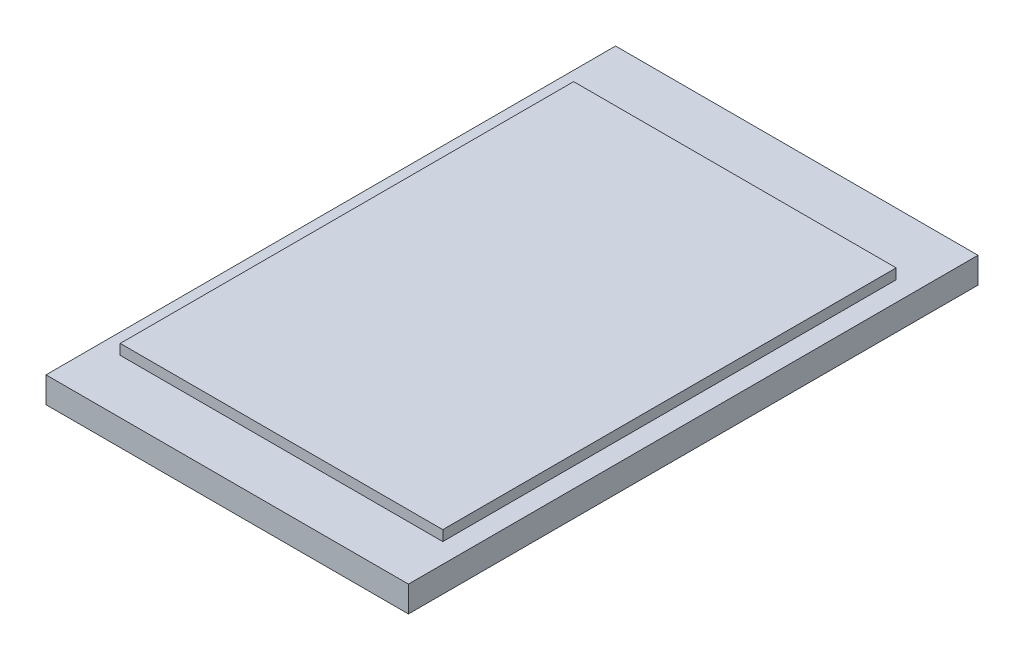
ISO-10303-21;
HEADER;
FILE_DESCRIPTION(('STEP AP214'),'2;1');
FILE_NAME('part.step','',(''),(''),'','','');
FILE_SCHEMA(('AUTOMOTIVE_DESIGN { 1 0 10303 214 1 1 1 1 }'));
ENDSEC;
DATA;
#1=APPLICATION_CONTEXT('core data for automotive mechanical design processes');
#2=APPLICATION_PROTOCOL_DEFINITION('international standard','automotive_design',2000,#1);
#3=PRODUCT_CONTEXT('',#1,'mechanical');
#4=PRODUCT('Part','Part','',(#3));
#5=PRODUCT_RELATED_PRODUCT_CATEGORY('part','',(#4));
#6=PRODUCT_DEFINITION_FORMATION('','',#4);
#7=PRODUCT_DEFINITION_CONTEXT('part definition',#1,'design');
#8=PRODUCT_DEFINITION('design','',#6,#7);
#9=PRODUCT_DEFINITION_SHAPE('','',#8);
#10=(LENGTH_UNIT() NAMED_UNIT(*) SI_UNIT(.MILLI.,.METRE.));
#11=(NAMED_UNIT(*) PLANE_ANGLE_UNIT() SI_UNIT($,.RADIAN.));
#12=(NAMED_UNIT(*) SI_UNIT($,.STERADIAN.) SOLID_ANGLE_UNIT());
#13=UNCERTAINTY_MEASURE_WITH_UNIT(LENGTH_MEASURE(1.E-05),#10,'distance_accuracy_value','');
#14=(GEOMETRIC_REPRESENTATION_CONTEXT(3) GLOBAL_UNCERTAINTY_ASSIGNED_CONTEXT((#13)) GLOBAL_UNIT_ASSIGNED_CONTEXT((#10,
#11,#12)) REPRESENTATION_CONTEXT('',''));
#15=CARTESIAN_POINT('',(0.,0.,0.));
#16=DIRECTION('',(0.,0.,1.));
#17=DIRECTION('',(1.,0.,0.));
#18=AXIS2_PLACEMENT_3D('',#15,#16,#17);
#19=CARTESIAN_POINT('',(-79.0291262135922,5.,-64.0776699029125));
#20=DIRECTION('',(1.,0.,0.));
#21=DIRECTION('',(0.,0.,-1.));
#22=AXIS2_PLACEMENT_3D('',#19,#20,#21);
#23=PLANE('',#22);
#24=DIRECTION('',(0.,0.,1.));
#25=VECTOR('',#24,1.);
#26=CARTESIAN_POINT('',(-79.0291262135922,0.,-64.0776699029125));
#27=LINE('',#26,#25);
#28=CARTESIAN_POINT('',(-79.0291262135922,0.,-64.0776699029125));
#29=VERTEX_POINT('',#28);
#30=CARTESIAN_POINT('',(-79.0291262135922,0.,45.9223300970875));
#31=VERTEX_POINT('',#30);
#32=EDGE_CURVE('E124',#29,#31,#27,.T.);
#33=ORIENTED_EDGE('',*,*,#32,.T.);
#34=DIRECTION('',(0.,-1.,0.));
#35=VECTOR('',#34,1.);
#36=CARTESIAN_POINT('',(-79.0291262135922,5.,45.9223300970875));
#37=LINE('',#36,#35);
#38=CARTESIAN_POINT('',(-79.0291262135922,5.,45.9223300970875));
#39=VERTEX_POINT('',#38);
#40=EDGE_CURVE('E11',#39,#31,#37,.T.);
#41=ORIENTED_EDGE('',*,*,#40,.F.);
#42=DIRECTION('',(0.,0.,1.));
#43=VECTOR('',#42,1.);
#44=CARTESIAN_POINT('',(-79.0291262135922,5.,-64.0776699029125));
#45=LINE('',#44,#43);
#46=CARTESIAN_POINT('',(-79.0291262135922,5.,-64.0776699029125));
#47=VERTEX_POINT('',#46);
#48=EDGE_CURVE('E133',#47,#39,#45,.T.);
#49=ORIENTED_EDGE('',*,*,#48,.F.);
#50=DIRECTION('',(0.,-1.,0.));
#51=VECTOR('',#50,1.);
#52=CARTESIAN_POINT('',(-79.0291262135922,5.,-64.0776699029125));
#53=LINE('',#52,#51);
#54=EDGE_CURVE('E142',#47,#29,#53,.T.);
#55=ORIENTED_EDGE('',*,*,#54,.T.);
#56=EDGE_LOOP('',(#33,#41,#49,#55));
#57=FACE_BOUND('',#56,.T.);
#58=ADVANCED_FACE('F40',(#57),#23,.F.);
#59=CARTESIAN_POINT('',(-79.0291262135922,5.,45.9223300970875));
#60=DIRECTION('',(0.,0.,-1.));
#61=DIRECTION('',(-1.,0.,0.));
#62=AXIS2_PLACEMENT_3D('',#59,#60,#61);
#63=PLANE('',#62);
#64=DIRECTION('',(1.,0.,0.));
#65=VECTOR('',#64,1.);
#66=CARTESIAN_POINT('',(-79.0291262135922,0.,45.9223300970875));
#67=LINE('',#66,#65);
#68=CARTESIAN_POINT('',(-9.02912621359225,0.,45.9223300970875));
#69=VERTEX_POINT('',#68);
#70=EDGE_CURVE('E127',#31,#69,#67,.T.);
#71=ORIENTED_EDGE('',*,*,#70,.T.);
#72=DIRECTION('',(0.,-1.,0.));
#73=VECTOR('',#72,1.);
#74=CARTESIAN_POINT('',(-9.02912621359225,5.,45.9223300970875));
#75=LINE('',#74,#73);
#76=CARTESIAN_POINT('',(-9.02912621359225,5.,45.9223300970875));
#77=VERTEX_POINT('',#76);
#78=EDGE_CURVE('E47',#77,#69,#75,.T.);
#79=ORIENTED_EDGE('',*,*,#78,.F.);
#80=DIRECTION('',(1.,0.,0.));
#81=VECTOR('',#80,1.);
#82=CARTESIAN_POINT('',(-79.0291262135922,5.,45.9223300970875));
#83=LINE('',#82,#81);
#84=EDGE_CURVE('E136',#39,#77,#83,.T.);
#85=ORIENTED_EDGE('',*,*,#84,.F.);
#86=ORIENTED_EDGE('',*,*,#40,.T.);
#87=EDGE_LOOP('',(#71,#79,#85,#86));
#88=FACE_BOUND('',#87,.T.);
#89=ADVANCED_FACE('F173',(#88),#63,.F.);
#90=CARTESIAN_POINT('',(-9.02912621359227,5.,-64.0776699029125));
#91=DIRECTION('',(-1.,0.,0.));
#92=DIRECTION('',(0.,0.,1.));
#93=AXIS2_PLACEMENT_3D('',#90,#91,#92);
#94=PLANE('',#93);
#95=DIRECTION('',(0.,0.,-1.));
#96=VECTOR('',#95,1.);
#97=CARTESIAN_POINT('',(-9.02912621359227,0.,-64.0776699029125));
#98=LINE('',#97,#96);
#99=CARTESIAN_POINT('',(-9.02912621359227,0.,-64.0776699029125));
#100=VERTEX_POINT('',#99);
#101=EDGE_CURVE('E145',#69,#100,#98,.T.);
#102=ORIENTED_EDGE('',*,*,#101,.T.);
#103=DIRECTION('',(0.,-1.,0.));
#104=VECTOR('',#103,1.);
#105=CARTESIAN_POINT('',(-9.02912621359227,5.,-64.0776699029125));
#106=LINE('',#105,#104);
#107=CARTESIAN_POINT('',(-9.02912621359227,5.,-64.0776699029125));
#108=VERTEX_POINT('',#107);
#109=EDGE_CURVE('E150',#108,#100,#106,.T.);
#110=ORIENTED_EDGE('',*,*,#109,.F.);
#111=DIRECTION('',(0.,0.,-1.));
#112=VECTOR('',#111,1.);
#113=CARTESIAN_POINT('',(-9.02912621359227,5.,-64.0776699029125));
#114=LINE('',#113,#112);
#115=EDGE_CURVE('E139',#77,#108,#114,.T.);
#116=ORIENTED_EDGE('',*,*,#115,.F.);
#117=ORIENTED_EDGE('',*,*,#78,.T.);
#118=EDGE_LOOP('',(#102,#110,#116,#117));
#119=FACE_BOUND('',#118,.T.);
#120=ADVANCED_FACE('F157',(#119),#94,.F.);
#121=CARTESIAN_POINT('',(-79.0291262135922,5.,-64.0776699029125));
#122=DIRECTION('',(0.,0.,1.));
#123=DIRECTION('',(1.,0.,0.));
#124=AXIS2_PLACEMENT_3D('',#121,#122,#123);
#125=PLANE('',#124);
#126=DIRECTION('',(-1.,0.,0.));
#127=VECTOR('',#126,1.);
#128=CARTESIAN_POINT('',(-79.0291262135922,0.,-64.0776699029125));
#129=LINE('',#128,#127);
#130=EDGE_CURVE('E137',#100,#29,#129,.T.);
#131=ORIENTED_EDGE('',*,*,#130,.T.);
#132=ORIENTED_EDGE('',*,*,#54,.F.);
#133=DIRECTION('',(-1.,0.,0.));
#134=VECTOR('',#133,1.);
#135=CARTESIAN_POINT('',(-79.0291262135922,5.,-64.0776699029125));
#136=LINE('',#135,#134);
#137=EDGE_CURVE('E141',#108,#47,#136,.T.);
#138=ORIENTED_EDGE('',*,*,#137,.F.);
#139=ORIENTED_EDGE('',*,*,#109,.T.);
#140=EDGE_LOOP('',(#131,#132,#138,#139));
#141=FACE_BOUND('',#140,.T.);
#142=ADVANCED_FACE('F166',(#141),#125,.F.);
#143=CARTESIAN_POINT('',(0.,5.,0.));
#144=DIRECTION('',(0.,1.,0.));
#145=DIRECTION('',(0.,0.,1.));
#146=AXIS2_PLACEMENT_3D('',#143,#144,#145);
#147=PLANE('',#146);
#148=DIRECTION('',(0.,0.,1.));
#149=VECTOR('',#148,1.);
#150=CARTESIAN_POINT('',(-75.1181150193644,5.,-52.0716808318743));
#151=LINE('',#150,#149);
#152=CARTESIAN_POINT('',(-75.1181150193644,5.,-52.0716808318743));
#153=VERTEX_POINT('',#152);
#154=CARTESIAN_POINT('',(-75.1181150193644,5.,35.4961734486357));
#155=VERTEX_POINT('',#154);
#156=EDGE_CURVE('E54',#153,#155,#151,.T.);
#157=ORIENTED_EDGE('',*,*,#156,.F.);
#158=DIRECTION('',(-1.,0.,0.));
#159=VECTOR('',#158,1.);
#160=CARTESIAN_POINT('',(-75.1181150193644,5.,-52.0716808318743));
#161=LINE('',#160,#159);
#162=CARTESIAN_POINT('',(-12.8275795002387,5.,-52.0716808318743));
#163=VERTEX_POINT('',#162);
#164=EDGE_CURVE('E58',#163,#153,#161,.T.);
#165=ORIENTED_EDGE('',*,*,#164,.F.);
#166=DIRECTION('',(0.,0.,-1.));
#167=VECTOR('',#166,1.);
#168=CARTESIAN_POINT('',(-12.8275795002387,5.,-52.0716808318743));
#169=LINE('',#168,#167);
#170=CARTESIAN_POINT('',(-12.8275795002387,5.,35.4961734486357));
#171=VERTEX_POINT('',#170);
#172=EDGE_CURVE('E311',#171,#163,#169,.T.);
#173=ORIENTED_EDGE('',*,*,#172,.F.);
#174=DIRECTION('',(1.,0.,0.));
#175=VECTOR('',#174,1.);
#176=CARTESIAN_POINT('',(-75.1181150193644,5.,35.4961734486357));
#177=LINE('',#176,#175);
#178=EDGE_CURVE('E317',#155,#171,#177,.T.);
#179=ORIENTED_EDGE('',*,*,#178,.F.);
#180=EDGE_LOOP('',(#157,#165,#173,#179));
#181=FACE_BOUND('',#180,.T.);
#182=ORIENTED_EDGE('',*,*,#48,.T.);
#183=ORIENTED_EDGE('',*,*,#84,.T.);
#184=ORIENTED_EDGE('',*,*,#115,.T.);
#185=ORIENTED_EDGE('',*,*,#137,.T.);
#186=EDGE_LOOP('',(#182,#183,#184,#185));
#187=FACE_BOUND('',#186,.T.);
#188=ADVANCED_FACE('F172',(#181,#187),#147,.T.);
#189=CARTESIAN_POINT('',(0.,0.,0.));
#190=DIRECTION('',(0.,1.,0.));
#191=DIRECTION('',(0.,0.,1.));
#192=AXIS2_PLACEMENT_3D('',#189,#190,#191);
#193=PLANE('',#192);
#194=ORIENTED_EDGE('',*,*,#32,.F.);
#195=ORIENTED_EDGE('',*,*,#130,.F.);
#196=ORIENTED_EDGE('',*,*,#101,.F.);
#197=ORIENTED_EDGE('',*,*,#70,.F.);
#198=EDGE_LOOP('',(#194,#195,#196,#197));
#199=FACE_BOUND('',#198,.T.);
#200=ADVANCED_FACE('F163',(#199),#193,.F.);
#201=CARTESIAN_POINT('',(-75.1181150193644,7.,-52.0716808318743));
#202=DIRECTION('',(1.,0.,0.));
#203=DIRECTION('',(0.,0.,-1.));
#204=AXIS2_PLACEMENT_3D('',#201,#202,#203);
#205=PLANE('',#204);
#206=ORIENTED_EDGE('',*,*,#156,.T.);
#207=DIRECTION('',(0.,-1.,0.));
#208=VECTOR('',#207,1.);
#209=CARTESIAN_POINT('',(-75.1181150193644,7.,35.4961734486357));
#210=LINE('',#209,#208);
#211=CARTESIAN_POINT('',(-75.1181150193644,7.,35.4961734486357));
#212=VERTEX_POINT('',#211);
#213=EDGE_CURVE('E107',#212,#155,#210,.T.);
#214=ORIENTED_EDGE('',*,*,#213,.F.);
#215=DIRECTION('',(0.,0.,1.));
#216=VECTOR('',#215,1.);
#217=CARTESIAN_POINT('',(-75.1181150193644,7.,-52.0716808318743));
#218=LINE('',#217,#216);
#219=CARTESIAN_POINT('',(-75.1181150193644,7.,-52.0716808318743));
#220=VERTEX_POINT('',#219);
#221=EDGE_CURVE('E113',#220,#212,#218,.T.);
#222=ORIENTED_EDGE('',*,*,#221,.F.);
#223=DIRECTION('',(0.,-1.,0.));
#224=VECTOR('',#223,1.);
#225=CARTESIAN_POINT('',(-75.1181150193644,7.,-52.0716808318743));
#226=LINE('',#225,#224);
#227=EDGE_CURVE('E309',#220,#153,#226,.T.);
#228=ORIENTED_EDGE('',*,*,#227,.T.);
#229=EDGE_LOOP('',(#206,#214,#222,#228));
#230=FACE_BOUND('',#229,.T.);
#231=ADVANCED_FACE('F123',(#230),#205,.F.);
#232=CARTESIAN_POINT('',(-75.1181150193644,7.,35.4961734486357));
#233=DIRECTION('',(0.,0.,-1.));
#234=DIRECTION('',(-1.,0.,0.));
#235=AXIS2_PLACEMENT_3D('',#232,#233,#234);
#236=PLANE('',#235);
#237=ORIENTED_EDGE('',*,*,#178,.T.);
#238=DIRECTION('',(0.,-1.,0.));
#239=VECTOR('',#238,1.);
#240=CARTESIAN_POINT('',(-12.8275795002387,7.,35.4961734486357));
#241=LINE('',#240,#239);
#242=CARTESIAN_POINT('',(-12.8275795002387,7.,35.4961734486357));
#243=VERTEX_POINT('',#242);
#244=EDGE_CURVE('E109',#243,#171,#241,.T.);
#245=ORIENTED_EDGE('',*,*,#244,.F.);
#246=DIRECTION('',(1.,0.,0.));
#247=VECTOR('',#246,1.);
#248=CARTESIAN_POINT('',(-75.1181150193644,7.,35.4961734486357));
#249=LINE('',#248,#247);
#250=EDGE_CURVE('E102',#212,#243,#249,.T.);
#251=ORIENTED_EDGE('',*,*,#250,.F.);
#252=ORIENTED_EDGE('',*,*,#213,.T.);
#253=EDGE_LOOP('',(#237,#245,#251,#252));
#254=FACE_BOUND('',#253,.T.);
#255=ADVANCED_FACE('F105',(#254),#236,.F.);
#256=CARTESIAN_POINT('',(-12.8275795002387,7.,-52.0716808318743));
#257=DIRECTION('',(-1.,0.,0.));
#258=DIRECTION('',(0.,0.,1.));
#259=AXIS2_PLACEMENT_3D('',#256,#257,#258);
#260=PLANE('',#259);
#261=ORIENTED_EDGE('',*,*,#172,.T.);
#262=DIRECTION('',(0.,-1.,0.));
#263=VECTOR('',#262,1.);
#264=CARTESIAN_POINT('',(-12.8275795002387,7.,-52.0716808318743));
#265=LINE('',#264,#263);
#266=CARTESIAN_POINT('',(-12.8275795002387,7.,-52.0716808318743));
#267=VERTEX_POINT('',#266);
#268=EDGE_CURVE('E129',#267,#163,#265,.T.);
#269=ORIENTED_EDGE('',*,*,#268,.F.);
#270=DIRECTION('',(0.,0.,-1.));
#271=VECTOR('',#270,1.);
#272=CARTESIAN_POINT('',(-12.8275795002387,7.,-52.0716808318743));
#273=LINE('',#272,#271);
#274=EDGE_CURVE('E112',#243,#267,#273,.T.);
#275=ORIENTED_EDGE('',*,*,#274,.F.);
#276=ORIENTED_EDGE('',*,*,#244,.T.);
#277=EDGE_LOOP('',(#261,#269,#275,#276));
#278=FACE_BOUND('',#277,.T.);
#279=ADVANCED_FACE('F191',(#278),#260,.F.);
#280=CARTESIAN_POINT('',(-75.1181150193644,7.,-52.0716808318743));
#281=DIRECTION('',(0.,0.,1.));
#282=DIRECTION('',(1.,0.,0.));
#283=AXIS2_PLACEMENT_3D('',#280,#281,#282);
#284=PLANE('',#283);
#285=ORIENTED_EDGE('',*,*,#164,.T.);
#286=ORIENTED_EDGE('',*,*,#227,.F.);
#287=DIRECTION('',(-1.,0.,0.));
#288=VECTOR('',#287,1.);
#289=CARTESIAN_POINT('',(-75.1181150193644,7.,-52.0716808318743));
#290=LINE('',#289,#288);
#291=EDGE_CURVE('E118',#267,#220,#290,.T.);
#292=ORIENTED_EDGE('',*,*,#291,.F.);
#293=ORIENTED_EDGE('',*,*,#268,.T.);
#294=EDGE_LOOP('',(#285,#286,#292,#293));
#295=FACE_BOUND('',#294,.T.);
#296=ADVANCED_FACE('F194',(#295),#284,.F.);
#297=CARTESIAN_POINT('',(0.,7.,0.));
#298=DIRECTION('',(0.,1.,0.));
#299=DIRECTION('',(0.,0.,1.));
#300=AXIS2_PLACEMENT_3D('',#297,#298,#299);
#301=PLANE('',#300);
#302=ORIENTED_EDGE('',*,*,#221,.T.);
#303=ORIENTED_EDGE('',*,*,#250,.T.);
#304=ORIENTED_EDGE('',*,*,#274,.T.);
#305=ORIENTED_EDGE('',*,*,#291,.T.);
#306=EDGE_LOOP('',(#302,#303,#304,#305));
#307=FACE_BOUND('',#306,.T.);
#308=ADVANCED_FACE('F116',(#307),#301,.T.);
#309=CLOSED_SHELL('',(#58,#89,#120,#142,#188,#200,#231,#255,#279,#296,#308));
#310=MANIFOLD_SOLID_BREP('B2',#309);
#311=ADVANCED_BREP_SHAPE_REPRESENTATION('',(#18,#310),#14);
#312=SHAPE_DEFINITION_REPRESENTATION(#9,#311);
ENDSEC;
END-ISO-10303-21;
